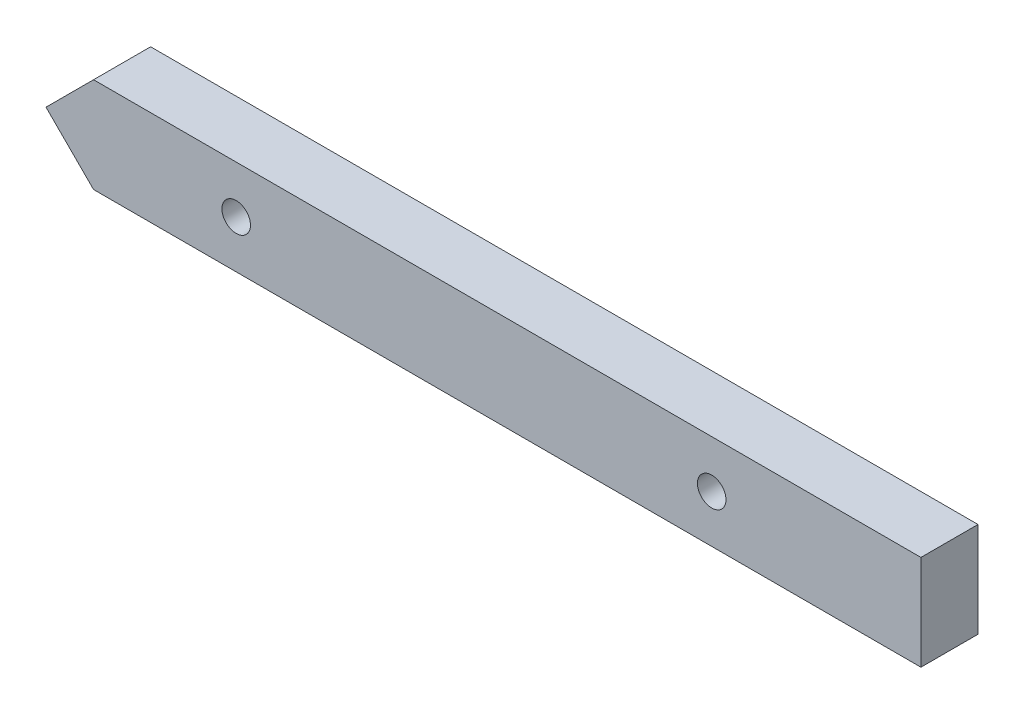
ISO-10303-21;
HEADER;
FILE_DESCRIPTION(('STEP AP214'),'2;1');
FILE_NAME('part.step','',(''),(''),'','','');
FILE_SCHEMA(('AUTOMOTIVE_DESIGN { 1 0 10303 214 1 1 1 1 }'));
ENDSEC;
DATA;
#1=APPLICATION_CONTEXT('core data for automotive mechanical design processes');
#2=APPLICATION_PROTOCOL_DEFINITION('international standard','automotive_design',2000,#1);
#3=PRODUCT_CONTEXT('',#1,'mechanical');
#4=PRODUCT('Part','Part','',(#3));
#5=PRODUCT_RELATED_PRODUCT_CATEGORY('part','',(#4));
#6=PRODUCT_DEFINITION_FORMATION('','',#4);
#7=PRODUCT_DEFINITION_CONTEXT('part definition',#1,'design');
#8=PRODUCT_DEFINITION('design','',#6,#7);
#9=PRODUCT_DEFINITION_SHAPE('','',#8);
#10=(LENGTH_UNIT() NAMED_UNIT(*) SI_UNIT(.MILLI.,.METRE.));
#11=(NAMED_UNIT(*) PLANE_ANGLE_UNIT() SI_UNIT($,.RADIAN.));
#12=(NAMED_UNIT(*) SI_UNIT($,.STERADIAN.) SOLID_ANGLE_UNIT());
#13=UNCERTAINTY_MEASURE_WITH_UNIT(LENGTH_MEASURE(1.E-05),#10,'distance_accuracy_value','');
#14=(GEOMETRIC_REPRESENTATION_CONTEXT(3) GLOBAL_UNCERTAINTY_ASSIGNED_CONTEXT((#13)) GLOBAL_UNIT_ASSIGNED_CONTEXT((#10,
#11,#12)) REPRESENTATION_CONTEXT('',''));
#15=CARTESIAN_POINT('',(0.,0.,0.));
#16=DIRECTION('',(0.,0.,1.));
#17=DIRECTION('',(1.,0.,0.));
#18=AXIS2_PLACEMENT_3D('',#15,#16,#17);
#19=CARTESIAN_POINT('',(-46.,-5.,6.));
#20=DIRECTION('',(0.,1.,0.));
#21=DIRECTION('',(0.,0.,1.));
#22=AXIS2_PLACEMENT_3D('',#19,#20,#21);
#23=PLANE('',#22);
#24=DIRECTION('',(1.,0.,0.));
#25=VECTOR('',#24,1.);
#26=CARTESIAN_POINT('',(-46.,-5.,6.));
#27=LINE('',#26,#25);
#28=CARTESIAN_POINT('',(-41.,-5.,6.));
#29=VERTEX_POINT('',#28);
#30=CARTESIAN_POINT('',(46.,-5.,6.));
#31=VERTEX_POINT('',#30);
#32=EDGE_CURVE('E87',#29,#31,#27,.T.);
#33=ORIENTED_EDGE('',*,*,#32,.F.);
#34=DIRECTION('',(0.,0.,1.));
#35=VECTOR('',#34,1.);
#36=CARTESIAN_POINT('',(-41.,-5.,0.));
#37=LINE('',#36,#35);
#38=CARTESIAN_POINT('',(-41.,-5.,0.));
#39=VERTEX_POINT('',#38);
#40=EDGE_CURVE('E92',#39,#29,#37,.T.);
#41=ORIENTED_EDGE('',*,*,#40,.F.);
#42=DIRECTION('',(1.,0.,0.));
#43=VECTOR('',#42,1.);
#44=CARTESIAN_POINT('',(-46.,-5.,0.));
#45=LINE('',#44,#43);
#46=CARTESIAN_POINT('',(46.,-5.,0.));
#47=VERTEX_POINT('',#46);
#48=EDGE_CURVE('E77',#39,#47,#45,.T.);
#49=ORIENTED_EDGE('',*,*,#48,.T.);
#50=DIRECTION('',(0.,0.,-1.));
#51=VECTOR('',#50,1.);
#52=CARTESIAN_POINT('',(46.,-5.,6.));
#53=LINE('',#52,#51);
#54=EDGE_CURVE('E11',#31,#47,#53,.T.);
#55=ORIENTED_EDGE('',*,*,#54,.F.);
#56=EDGE_LOOP('',(#33,#41,#49,#55));
#57=FACE_BOUND('',#56,.T.);
#58=ADVANCED_FACE('F33',(#57),#23,.F.);
#59=CARTESIAN_POINT('',(46.,5.,6.));
#60=DIRECTION('',(-1.,0.,0.));
#61=DIRECTION('',(0.,-1.,0.));
#62=AXIS2_PLACEMENT_3D('',#59,#60,#61);
#63=PLANE('',#62);
#64=DIRECTION('',(0.,1.,0.));
#65=VECTOR('',#64,1.);
#66=CARTESIAN_POINT('',(46.,5.,0.));
#67=LINE('',#66,#65);
#68=CARTESIAN_POINT('',(46.,5.,0.));
#69=VERTEX_POINT('',#68);
#70=EDGE_CURVE('E68',#47,#69,#67,.T.);
#71=ORIENTED_EDGE('',*,*,#70,.T.);
#72=DIRECTION('',(0.,0.,-1.));
#73=VECTOR('',#72,1.);
#74=CARTESIAN_POINT('',(46.,5.,6.));
#75=LINE('',#74,#73);
#76=CARTESIAN_POINT('',(46.,5.,6.));
#77=VERTEX_POINT('',#76);
#78=EDGE_CURVE('E40',#77,#69,#75,.T.);
#79=ORIENTED_EDGE('',*,*,#78,.F.);
#80=DIRECTION('',(0.,1.,0.));
#81=VECTOR('',#80,1.);
#82=CARTESIAN_POINT('',(46.,5.,6.));
#83=LINE('',#82,#81);
#84=EDGE_CURVE('E56',#31,#77,#83,.T.);
#85=ORIENTED_EDGE('',*,*,#84,.F.);
#86=ORIENTED_EDGE('',*,*,#54,.T.);
#87=EDGE_LOOP('',(#71,#79,#85,#86));
#88=FACE_BOUND('',#87,.T.);
#89=ADVANCED_FACE('F70',(#88),#63,.F.);
#90=CARTESIAN_POINT('',(-46.,5.,6.));
#91=DIRECTION('',(0.,-1.,0.));
#92=DIRECTION('',(1.,0.,0.));
#93=AXIS2_PLACEMENT_3D('',#90,#91,#92);
#94=PLANE('',#93);
#95=DIRECTION('',(-1.,0.,0.));
#96=VECTOR('',#95,1.);
#97=CARTESIAN_POINT('',(-46.,5.,0.));
#98=LINE('',#97,#96);
#99=CARTESIAN_POINT('',(-41.,5.,0.));
#100=VERTEX_POINT('',#99);
#101=EDGE_CURVE('E76',#69,#100,#98,.T.);
#102=ORIENTED_EDGE('',*,*,#101,.T.);
#103=DIRECTION('',(0.,0.,1.));
#104=VECTOR('',#103,1.);
#105=CARTESIAN_POINT('',(-41.,5.,0.));
#106=LINE('',#105,#104);
#107=CARTESIAN_POINT('',(-41.,5.,6.));
#108=VERTEX_POINT('',#107);
#109=EDGE_CURVE('E103',#100,#108,#106,.T.);
#110=ORIENTED_EDGE('',*,*,#109,.T.);
#111=DIRECTION('',(-1.,0.,0.));
#112=VECTOR('',#111,1.);
#113=CARTESIAN_POINT('',(-46.,5.,6.));
#114=LINE('',#113,#112);
#115=EDGE_CURVE('E84',#77,#108,#114,.T.);
#116=ORIENTED_EDGE('',*,*,#115,.F.);
#117=ORIENTED_EDGE('',*,*,#78,.T.);
#118=EDGE_LOOP('',(#102,#110,#116,#117));
#119=FACE_BOUND('',#118,.T.);
#120=ADVANCED_FACE('F81',(#119),#94,.F.);
#121=CARTESIAN_POINT('',(0.,0.,6.));
#122=DIRECTION('',(0.,0.,1.));
#123=DIRECTION('',(1.,0.,0.));
#124=AXIS2_PLACEMENT_3D('',#121,#122,#123);
#125=PLANE('',#124);
#126=CARTESIAN_POINT('',(24.,0.,6.));
#127=DIRECTION('',(0.,0.,1.));
#128=DIRECTION('',(1.,0.,0.));
#129=AXIS2_PLACEMENT_3D('',#126,#127,#128);
#130=CIRCLE('',#129,1.5);
#131=CARTESIAN_POINT('',(25.5,0.,6.));
#132=VERTEX_POINT('',#131);
#133=EDGE_CURVE('E117',#132,#132,#130,.T.);
#134=ORIENTED_EDGE('',*,*,#133,.F.);
#135=EDGE_LOOP('',(#134));
#136=FACE_BOUND('',#135,.T.);
#137=CARTESIAN_POINT('',(-26.,0.,6.));
#138=DIRECTION('',(0.,0.,1.));
#139=DIRECTION('',(1.,0.,0.));
#140=AXIS2_PLACEMENT_3D('',#137,#138,#139);
#141=CIRCLE('',#140,1.5);
#142=CARTESIAN_POINT('',(-24.5,0.,6.));
#143=VERTEX_POINT('',#142);
#144=EDGE_CURVE('E111',#143,#143,#141,.T.);
#145=ORIENTED_EDGE('',*,*,#144,.F.);
#146=EDGE_LOOP('',(#145));
#147=FACE_BOUND('',#146,.T.);
#148=DIRECTION('',(0.707106781186547,0.707106781186548,0.));
#149=VECTOR('',#148,1.);
#150=CARTESIAN_POINT('',(-46.,0.,6.));
#151=LINE('',#150,#149);
#152=CARTESIAN_POINT('',(-46.,0.,6.));
#153=VERTEX_POINT('',#152);
#154=EDGE_CURVE('E106',#153,#108,#151,.T.);
#155=ORIENTED_EDGE('',*,*,#154,.F.);
#156=DIRECTION('',(-0.707106781186547,0.707106781186548,0.));
#157=VECTOR('',#156,1.);
#158=CARTESIAN_POINT('',(-46.,0.,6.));
#159=LINE('',#158,#157);
#160=EDGE_CURVE('E100',#29,#153,#159,.T.);
#161=ORIENTED_EDGE('',*,*,#160,.F.);
#162=ORIENTED_EDGE('',*,*,#32,.T.);
#163=ORIENTED_EDGE('',*,*,#84,.T.);
#164=ORIENTED_EDGE('',*,*,#115,.T.);
#165=EDGE_LOOP('',(#155,#161,#162,#163,#164));
#166=FACE_BOUND('',#165,.T.);
#167=ADVANCED_FACE('F132',(#136,#147,#166),#125,.T.);
#168=CARTESIAN_POINT('',(0.,0.,0.));
#169=DIRECTION('',(0.,0.,1.));
#170=DIRECTION('',(1.,0.,0.));
#171=AXIS2_PLACEMENT_3D('',#168,#169,#170);
#172=PLANE('',#171);
#173=CARTESIAN_POINT('',(24.,0.,0.));
#174=DIRECTION('',(0.,0.,1.));
#175=DIRECTION('',(1.,0.,0.));
#176=AXIS2_PLACEMENT_3D('',#173,#174,#175);
#177=CIRCLE('',#176,1.5);
#178=CARTESIAN_POINT('',(25.5,0.,0.));
#179=VERTEX_POINT('',#178);
#180=EDGE_CURVE('E114',#179,#179,#177,.T.);
#181=ORIENTED_EDGE('',*,*,#180,.T.);
#182=EDGE_LOOP('',(#181));
#183=FACE_BOUND('',#182,.T.);
#184=CARTESIAN_POINT('',(-26.,0.,0.));
#185=DIRECTION('',(0.,0.,1.));
#186=DIRECTION('',(1.,0.,0.));
#187=AXIS2_PLACEMENT_3D('',#184,#185,#186);
#188=CIRCLE('',#187,1.5);
#189=CARTESIAN_POINT('',(-24.5,0.,0.));
#190=VERTEX_POINT('',#189);
#191=EDGE_CURVE('E109',#190,#190,#188,.T.);
#192=ORIENTED_EDGE('',*,*,#191,.T.);
#193=EDGE_LOOP('',(#192));
#194=FACE_BOUND('',#193,.T.);
#195=DIRECTION('',(-0.707106781186547,0.707106781186548,0.));
#196=VECTOR('',#195,1.);
#197=CARTESIAN_POINT('',(-46.,0.,0.));
#198=LINE('',#197,#196);
#199=CARTESIAN_POINT('',(-46.,0.,0.));
#200=VERTEX_POINT('',#199);
#201=EDGE_CURVE('E97',#39,#200,#198,.T.);
#202=ORIENTED_EDGE('',*,*,#201,.T.);
#203=DIRECTION('',(0.707106781186547,0.707106781186548,0.));
#204=VECTOR('',#203,1.);
#205=CARTESIAN_POINT('',(-46.,0.,0.));
#206=LINE('',#205,#204);
#207=EDGE_CURVE('E47',#200,#100,#206,.T.);
#208=ORIENTED_EDGE('',*,*,#207,.T.);
#209=ORIENTED_EDGE('',*,*,#101,.F.);
#210=ORIENTED_EDGE('',*,*,#70,.F.);
#211=ORIENTED_EDGE('',*,*,#48,.F.);
#212=EDGE_LOOP('',(#202,#208,#209,#210,#211));
#213=FACE_BOUND('',#212,.T.);
#214=ADVANCED_FACE('F86',(#183,#194,#213),#172,.F.);
#215=CARTESIAN_POINT('',(-46.,0.,0.));
#216=DIRECTION('',(0.707106781186548,0.707106781186547,0.));
#217=DIRECTION('',(-0.707106781186547,0.707106781186548,0.));
#218=AXIS2_PLACEMENT_3D('',#215,#216,#217);
#219=PLANE('',#218);
#220=ORIENTED_EDGE('',*,*,#160,.T.);
#221=DIRECTION('',(0.,0.,1.));
#222=VECTOR('',#221,1.);
#223=CARTESIAN_POINT('',(-46.,0.,0.));
#224=LINE('',#223,#222);
#225=EDGE_CURVE('E95',#200,#153,#224,.T.);
#226=ORIENTED_EDGE('',*,*,#225,.F.);
#227=ORIENTED_EDGE('',*,*,#201,.F.);
#228=ORIENTED_EDGE('',*,*,#40,.T.);
#229=EDGE_LOOP('',(#220,#226,#227,#228));
#230=FACE_BOUND('',#229,.T.);
#231=ADVANCED_FACE('F145',(#230),#219,.F.);
#232=CARTESIAN_POINT('',(-46.,0.,0.));
#233=DIRECTION('',(0.707106781186548,-0.707106781186547,0.));
#234=DIRECTION('',(0.707106781186547,0.707106781186548,0.));
#235=AXIS2_PLACEMENT_3D('',#232,#233,#234);
#236=PLANE('',#235);
#237=ORIENTED_EDGE('',*,*,#154,.T.);
#238=ORIENTED_EDGE('',*,*,#109,.F.);
#239=ORIENTED_EDGE('',*,*,#207,.F.);
#240=ORIENTED_EDGE('',*,*,#225,.T.);
#241=EDGE_LOOP('',(#237,#238,#239,#240));
#242=FACE_BOUND('',#241,.T.);
#243=ADVANCED_FACE('F152',(#242),#236,.F.);
#244=CARTESIAN_POINT('',(-26.,0.,0.));
#245=DIRECTION('',(0.,0.,1.));
#246=DIRECTION('',(1.,0.,0.));
#247=AXIS2_PLACEMENT_3D('',#244,#245,#246);
#248=CYLINDRICAL_SURFACE('',#247,1.5);
#249=ORIENTED_EDGE('',*,*,#191,.F.);
#250=EDGE_LOOP('',(#249));
#251=FACE_BOUND('',#250,.T.);
#252=ORIENTED_EDGE('',*,*,#144,.T.);
#253=EDGE_LOOP('',(#252));
#254=FACE_BOUND('',#253,.T.);
#255=ADVANCED_FACE('F128',(#251,#254),#248,.F.);
#256=CARTESIAN_POINT('',(24.,0.,0.));
#257=DIRECTION('',(0.,0.,1.));
#258=DIRECTION('',(1.,0.,0.));
#259=AXIS2_PLACEMENT_3D('',#256,#257,#258);
#260=CYLINDRICAL_SURFACE('',#259,1.5);
#261=ORIENTED_EDGE('',*,*,#180,.F.);
#262=EDGE_LOOP('',(#261));
#263=FACE_BOUND('',#262,.T.);
#264=ORIENTED_EDGE('',*,*,#133,.T.);
#265=EDGE_LOOP('',(#264));
#266=FACE_BOUND('',#265,.T.);
#267=ADVANCED_FACE('F125',(#263,#266),#260,.F.);
#268=CLOSED_SHELL('',(#58,#89,#120,#167,#214,#231,#243,#255,#267));
#269=MANIFOLD_SOLID_BREP('B2',#268);
#270=ADVANCED_BREP_SHAPE_REPRESENTATION('',(#18,#269),#14);
#271=SHAPE_DEFINITION_REPRESENTATION(#9,#270);
ENDSEC;
END-ISO-10303-21;
